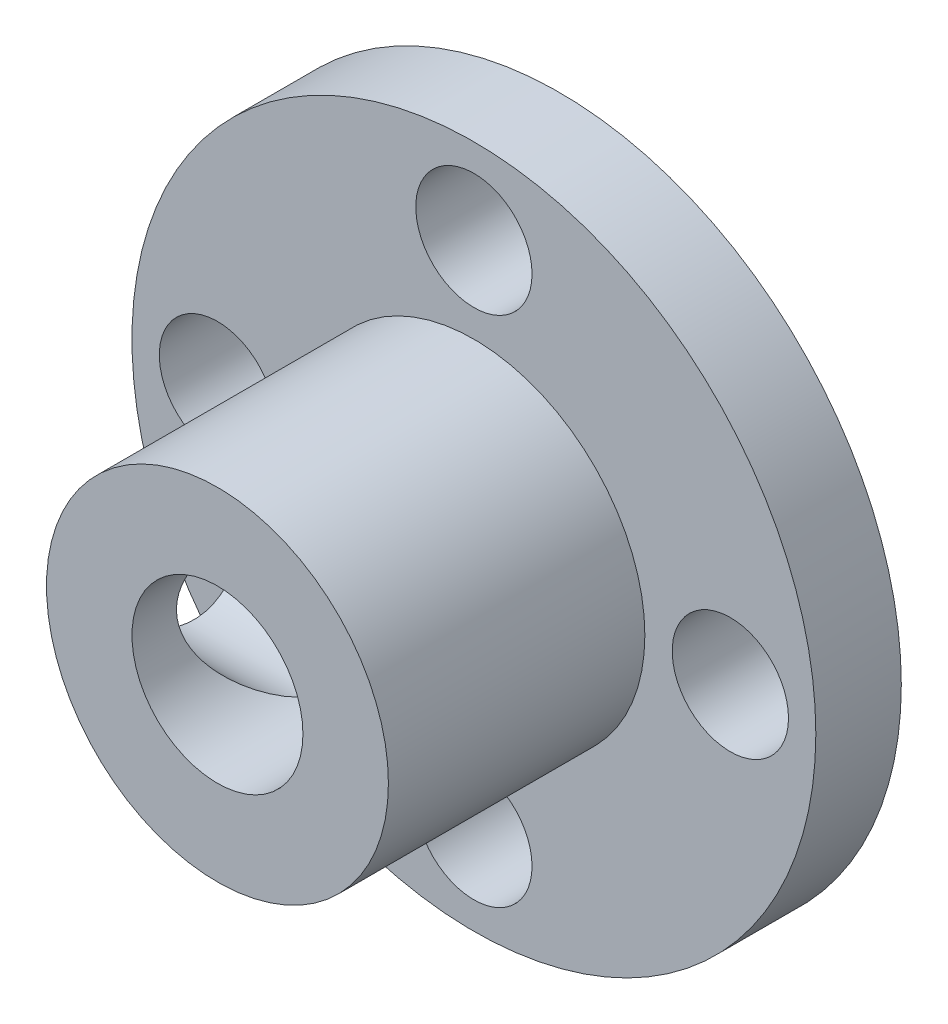
ISO-10303-21;
HEADER;
FILE_DESCRIPTION(('STEP AP214'),'2;1');
FILE_NAME('part.step','',(''),(''),'','','');
FILE_SCHEMA(('AUTOMOTIVE_DESIGN { 1 0 10303 214 1 1 1 1 }'));
ENDSEC;
DATA;
#1=APPLICATION_CONTEXT('core data for automotive mechanical design processes');
#2=APPLICATION_PROTOCOL_DEFINITION('international standard','automotive_design',2000,#1);
#3=PRODUCT_CONTEXT('',#1,'mechanical');
#4=PRODUCT('Part','Part','',(#3));
#5=PRODUCT_RELATED_PRODUCT_CATEGORY('part','',(#4));
#6=PRODUCT_DEFINITION_FORMATION('','',#4);
#7=PRODUCT_DEFINITION_CONTEXT('part definition',#1,'design');
#8=PRODUCT_DEFINITION('design','',#6,#7);
#9=PRODUCT_DEFINITION_SHAPE('','',#8);
#10=(LENGTH_UNIT() NAMED_UNIT(*) SI_UNIT(.MILLI.,.METRE.));
#11=(NAMED_UNIT(*) PLANE_ANGLE_UNIT() SI_UNIT($,.RADIAN.));
#12=(NAMED_UNIT(*) SI_UNIT($,.STERADIAN.) SOLID_ANGLE_UNIT());
#13=UNCERTAINTY_MEASURE_WITH_UNIT(LENGTH_MEASURE(1.E-05),#10,'distance_accuracy_value','');
#14=(GEOMETRIC_REPRESENTATION_CONTEXT(3) GLOBAL_UNCERTAINTY_ASSIGNED_CONTEXT((#13)) GLOBAL_UNIT_ASSIGNED_CONTEXT((#10,
#11,#12)) REPRESENTATION_CONTEXT('',''));
#15=CARTESIAN_POINT('',(0.,0.,0.));
#16=DIRECTION('',(0.,0.,1.));
#17=DIRECTION('',(1.,0.,0.));
#18=AXIS2_PLACEMENT_3D('',#15,#16,#17);
#19=CARTESIAN_POINT('',(0.,0.,3.175));
#20=DIRECTION('',(0.,0.,1.));
#21=DIRECTION('',(1.,0.,0.));
#22=AXIS2_PLACEMENT_3D('',#19,#20,#21);
#23=PLANE('',#22);
#24=CARTESIAN_POINT('',(0.,0.,3.175));
#25=DIRECTION('',(0.,0.,1.));
#26=DIRECTION('',(1.,0.,0.));
#27=AXIS2_PLACEMENT_3D('',#24,#25,#26);
#28=CIRCLE('',#27,12.7);
#29=CARTESIAN_POINT('',(12.7,0.,3.175));
#30=VERTEX_POINT('',#29);
#31=EDGE_CURVE('E11',#30,#30,#28,.T.);
#32=ORIENTED_EDGE('',*,*,#31,.T.);
#33=EDGE_LOOP('',(#32));
#34=FACE_BOUND('',#33,.T.);
#35=CARTESIAN_POINT('',(0.,9.525,3.175));
#36=DIRECTION('',(0.,0.,1.));
#37=DIRECTION('',(1.,0.,0.));
#38=AXIS2_PLACEMENT_3D('',#35,#36,#37);
#39=CIRCLE('',#38,2.159);
#40=CARTESIAN_POINT('',(2.159,9.525,3.175));
#41=VERTEX_POINT('',#40);
#42=EDGE_CURVE('E63',#41,#41,#39,.T.);
#43=ORIENTED_EDGE('',*,*,#42,.F.);
#44=EDGE_LOOP('',(#43));
#45=FACE_BOUND('',#44,.T.);
#46=CARTESIAN_POINT('',(9.52500000000027,2.68967068210316E-13,3.175));
#47=DIRECTION('',(0.,0.,1.));
#48=DIRECTION('',(1.,0.,0.));
#49=AXIS2_PLACEMENT_3D('',#46,#47,#48);
#50=CIRCLE('',#49,2.15900000000021);
#51=CARTESIAN_POINT('',(11.6840000000005,2.68967068210316E-13,3.175));
#52=VERTEX_POINT('',#51);
#53=EDGE_CURVE('E69',#52,#52,#50,.T.);
#54=ORIENTED_EDGE('',*,*,#53,.F.);
#55=EDGE_LOOP('',(#54));
#56=FACE_BOUND('',#55,.T.);
#57=CARTESIAN_POINT('',(5.37934136420633E-13,-9.525,3.175));
#58=DIRECTION('',(0.,0.,1.));
#59=DIRECTION('',(1.,0.,0.));
#60=AXIS2_PLACEMENT_3D('',#57,#58,#59);
#61=CIRCLE('',#60,2.15900000000058);
#62=CARTESIAN_POINT('',(2.15900000000112,-9.525,3.175));
#63=VERTEX_POINT('',#62);
#64=EDGE_CURVE('E97',#63,#63,#61,.T.);
#65=ORIENTED_EDGE('',*,*,#64,.F.);
#66=EDGE_LOOP('',(#65));
#67=FACE_BOUND('',#66,.T.);
#68=CARTESIAN_POINT('',(-9.52499999999973,-2.70133544286504E-13,3.175));
#69=DIRECTION('',(0.,0.,1.));
#70=DIRECTION('',(1.,0.,0.));
#71=AXIS2_PLACEMENT_3D('',#68,#69,#70);
#72=CIRCLE('',#71,2.15900000000043);
#73=CARTESIAN_POINT('',(-7.3659999999993,-2.70133544286504E-13,3.175));
#74=VERTEX_POINT('',#73);
#75=EDGE_CURVE('E92',#74,#74,#72,.T.);
#76=ORIENTED_EDGE('',*,*,#75,.F.);
#77=EDGE_LOOP('',(#76));
#78=FACE_BOUND('',#77,.T.);
#79=CARTESIAN_POINT('',(0.,0.,3.175));
#80=DIRECTION('',(0.,0.,1.));
#81=DIRECTION('',(1.,0.,0.));
#82=AXIS2_PLACEMENT_3D('',#79,#80,#81);
#83=CIRCLE('',#82,6.35);
#84=CARTESIAN_POINT('',(6.35,0.,3.175));
#85=VERTEX_POINT('',#84);
#86=EDGE_CURVE('E78',#85,#85,#83,.T.);
#87=ORIENTED_EDGE('',*,*,#86,.F.);
#88=EDGE_LOOP('',(#87));
#89=FACE_BOUND('',#88,.T.);
#90=ADVANCED_FACE('F49',(#34,#45,#56,#67,#78,#89),#23,.T.);
#91=CARTESIAN_POINT('',(0.,0.,0.));
#92=DIRECTION('',(0.,0.,1.));
#93=DIRECTION('',(1.,0.,0.));
#94=AXIS2_PLACEMENT_3D('',#91,#92,#93);
#95=PLANE('',#94);
#96=CARTESIAN_POINT('',(0.,0.,0.));
#97=DIRECTION('',(0.,0.,1.));
#98=DIRECTION('',(1.,0.,0.));
#99=AXIS2_PLACEMENT_3D('',#96,#97,#98);
#100=CIRCLE('',#99,12.7);
#101=CARTESIAN_POINT('',(12.7,0.,0.));
#102=VERTEX_POINT('',#101);
#103=EDGE_CURVE('E89',#102,#102,#100,.T.);
#104=ORIENTED_EDGE('',*,*,#103,.F.);
#105=EDGE_LOOP('',(#104));
#106=FACE_BOUND('',#105,.T.);
#107=CARTESIAN_POINT('',(0.,9.525,0.));
#108=DIRECTION('',(0.,0.,1.));
#109=DIRECTION('',(1.,0.,0.));
#110=AXIS2_PLACEMENT_3D('',#107,#108,#109);
#111=CIRCLE('',#110,2.159);
#112=CARTESIAN_POINT('',(2.159,9.525,0.));
#113=VERTEX_POINT('',#112);
#114=EDGE_CURVE('E86',#113,#113,#111,.T.);
#115=ORIENTED_EDGE('',*,*,#114,.T.);
#116=EDGE_LOOP('',(#115));
#117=FACE_BOUND('',#116,.T.);
#118=CARTESIAN_POINT('',(9.52500000000027,2.68967068210316E-13,0.));
#119=DIRECTION('',(0.,0.,1.));
#120=DIRECTION('',(1.,0.,0.));
#121=AXIS2_PLACEMENT_3D('',#118,#119,#120);
#122=CIRCLE('',#121,2.15900000000021);
#123=CARTESIAN_POINT('',(11.6840000000005,2.68967068210316E-13,0.));
#124=VERTEX_POINT('',#123);
#125=EDGE_CURVE('E82',#124,#124,#122,.T.);
#126=ORIENTED_EDGE('',*,*,#125,.T.);
#127=EDGE_LOOP('',(#126));
#128=FACE_BOUND('',#127,.T.);
#129=CARTESIAN_POINT('',(5.37934136420633E-13,-9.525,0.));
#130=DIRECTION('',(0.,0.,1.));
#131=DIRECTION('',(1.,0.,0.));
#132=AXIS2_PLACEMENT_3D('',#129,#130,#131);
#133=CIRCLE('',#132,2.15900000000058);
#134=CARTESIAN_POINT('',(2.15900000000112,-9.525,0.));
#135=VERTEX_POINT('',#134);
#136=EDGE_CURVE('E77',#135,#135,#133,.T.);
#137=ORIENTED_EDGE('',*,*,#136,.T.);
#138=EDGE_LOOP('',(#137));
#139=FACE_BOUND('',#138,.T.);
#140=CARTESIAN_POINT('',(-9.52499999999973,-2.70133544286504E-13,0.));
#141=DIRECTION('',(0.,0.,1.));
#142=DIRECTION('',(1.,0.,0.));
#143=AXIS2_PLACEMENT_3D('',#140,#141,#142);
#144=CIRCLE('',#143,2.15900000000043);
#145=CARTESIAN_POINT('',(-7.3659999999993,-2.70133544286504E-13,0.));
#146=VERTEX_POINT('',#145);
#147=EDGE_CURVE('E73',#146,#146,#144,.T.);
#148=ORIENTED_EDGE('',*,*,#147,.T.);
#149=EDGE_LOOP('',(#148));
#150=FACE_BOUND('',#149,.T.);
#151=CARTESIAN_POINT('',(0.,0.,0.));
#152=DIRECTION('',(0.,0.,1.));
#153=DIRECTION('',(1.,0.,0.));
#154=AXIS2_PLACEMENT_3D('',#151,#152,#153);
#155=CIRCLE('',#154,3.175);
#156=CARTESIAN_POINT('',(3.175,0.,0.));
#157=VERTEX_POINT('',#156);
#158=EDGE_CURVE('E133',#157,#157,#155,.T.);
#159=ORIENTED_EDGE('',*,*,#158,.T.);
#160=EDGE_LOOP('',(#159));
#161=FACE_BOUND('',#160,.T.);
#162=ADVANCED_FACE('F115',(#106,#117,#128,#139,#150,#161),#95,.F.);
#163=CARTESIAN_POINT('',(0.,9.525,3.175));
#164=DIRECTION('',(0.,0.,-1.));
#165=DIRECTION('',(-1.,0.,0.));
#166=AXIS2_PLACEMENT_3D('',#163,#164,#165);
#167=CYLINDRICAL_SURFACE('',#166,2.159);
#168=ORIENTED_EDGE('',*,*,#42,.T.);
#169=EDGE_LOOP('',(#168));
#170=FACE_BOUND('',#169,.T.);
#171=ORIENTED_EDGE('',*,*,#114,.F.);
#172=EDGE_LOOP('',(#171));
#173=FACE_BOUND('',#172,.T.);
#174=ADVANCED_FACE('F187',(#170,#173),#167,.F.);
#175=CARTESIAN_POINT('',(9.52500000000027,2.68967068210316E-13,3.175));
#176=DIRECTION('',(0.,0.,-1.));
#177=DIRECTION('',(-1.,0.,0.));
#178=AXIS2_PLACEMENT_3D('',#175,#176,#177);
#179=CYLINDRICAL_SURFACE('',#178,2.15900000000021);
#180=ORIENTED_EDGE('',*,*,#53,.T.);
#181=EDGE_LOOP('',(#180));
#182=FACE_BOUND('',#181,.T.);
#183=ORIENTED_EDGE('',*,*,#125,.F.);
#184=EDGE_LOOP('',(#183));
#185=FACE_BOUND('',#184,.T.);
#186=ADVANCED_FACE('F110',(#182,#185),#179,.F.);
#187=CARTESIAN_POINT('',(5.37934136420633E-13,-9.525,3.175));
#188=DIRECTION('',(0.,0.,-1.));
#189=DIRECTION('',(-1.,0.,0.));
#190=AXIS2_PLACEMENT_3D('',#187,#188,#189);
#191=CYLINDRICAL_SURFACE('',#190,2.15900000000058);
#192=ORIENTED_EDGE('',*,*,#64,.T.);
#193=EDGE_LOOP('',(#192));
#194=FACE_BOUND('',#193,.T.);
#195=ORIENTED_EDGE('',*,*,#136,.F.);
#196=EDGE_LOOP('',(#195));
#197=FACE_BOUND('',#196,.T.);
#198=ADVANCED_FACE('F184',(#194,#197),#191,.F.);
#199=CARTESIAN_POINT('',(-9.52499999999973,-2.70133544286504E-13,3.175));
#200=DIRECTION('',(0.,0.,-1.));
#201=DIRECTION('',(-1.,0.,0.));
#202=AXIS2_PLACEMENT_3D('',#199,#200,#201);
#203=CYLINDRICAL_SURFACE('',#202,2.15900000000043);
#204=ORIENTED_EDGE('',*,*,#75,.T.);
#205=EDGE_LOOP('',(#204));
#206=FACE_BOUND('',#205,.T.);
#207=ORIENTED_EDGE('',*,*,#147,.F.);
#208=EDGE_LOOP('',(#207));
#209=FACE_BOUND('',#208,.T.);
#210=ADVANCED_FACE('F51',(#206,#209),#203,.F.);
#211=CARTESIAN_POINT('',(0.,0.,3.175));
#212=DIRECTION('',(0.,0.,-1.));
#213=DIRECTION('',(-1.,0.,0.));
#214=AXIS2_PLACEMENT_3D('',#211,#212,#213);
#215=CYLINDRICAL_SURFACE('',#214,12.7);
#216=ORIENTED_EDGE('',*,*,#31,.F.);
#217=EDGE_LOOP('',(#216));
#218=FACE_BOUND('',#217,.T.);
#219=ORIENTED_EDGE('',*,*,#103,.T.);
#220=EDGE_LOOP('',(#219));
#221=FACE_BOUND('',#220,.T.);
#222=ADVANCED_FACE('F168',(#218,#221),#215,.T.);
#223=CARTESIAN_POINT('',(0.,0.,12.7));
#224=DIRECTION('',(0.,0.,-1.));
#225=DIRECTION('',(-1.,0.,0.));
#226=AXIS2_PLACEMENT_3D('',#223,#224,#225);
#227=CYLINDRICAL_SURFACE('',#226,3.175);
#228=CARTESIAN_POINT('',(-3.175,0.,11.049));
#229=CARTESIAN_POINT('',(-3.17499964754198,-0.0690055763738623,11.0489996447729));
#230=CARTESIAN_POINT('',(-3.17274390748717,-0.138016804472445,11.0466501704199));
#231=CARTESIAN_POINT('',(-3.16378113682923,-0.275444651350983,11.037312147526));
#232=CARTESIAN_POINT('',(-3.15707193190461,-0.343860963135813,11.0303213329366));
#233=CARTESIAN_POINT('',(-3.13041893145382,-0.54753452201083,11.002538203792));
#234=CARTESIAN_POINT('',(-3.10395004144857,-0.681111122689802,10.9749354901516));
#235=CARTESIAN_POINT('',(-3.03598154360495,-0.938685160780056,10.9039238656338));
#236=CARTESIAN_POINT('',(-2.9945873028953,-1.06274253320526,10.8606257469711));
#237=CARTESIAN_POINT('',(-2.89940038107255,-1.3001813317638,10.7607876396279));
#238=CARTESIAN_POINT('',(-2.84560716326233,-1.41356229546311,10.7042470777386));
#239=CARTESIAN_POINT('',(-2.70420471136509,-1.6726322835104,10.5550523090532));
#240=CARTESIAN_POINT('',(-2.61175725234849,-1.8126048357332,10.4570797566662));
#241=CARTESIAN_POINT('',(-2.41347832476399,-2.06934156734714,10.2451020255029));
#242=CARTESIAN_POINT('',(-2.30760765062263,-2.18603507633407,10.1310497683555));
#243=CARTESIAN_POINT('',(-2.1244924500471,-2.36166379077212,9.93081492890434));
#244=CARTESIAN_POINT('',(-2.04945697338893,-2.4268916918094,9.84800079588816));
#245=CARTESIAN_POINT('',(-1.89714912138227,-2.5477239042411,9.67740887268321));
#246=CARTESIAN_POINT('',(-1.81987525739339,-2.60332163121617,9.58962774039783));
#247=CARTESIAN_POINT('',(-1.66489148783412,-2.70505860643667,9.40942335405048));
#248=CARTESIAN_POINT('',(-1.58718244361147,-2.7512123794527,9.31700750495538));
#249=CARTESIAN_POINT('',(-1.43344607552509,-2.83433177139599,9.12690004490604));
#250=CARTESIAN_POINT('',(-1.35741705640832,-2.87130707756862,9.02921412989342));
#251=CARTESIAN_POINT('',(-1.23480497069507,-2.9255482392964,8.85928306536321));
#252=CARTESIAN_POINT('',(-1.18663136574347,-2.94532509126068,8.78898993207368));
#253=CARTESIAN_POINT('',(-1.09561635725242,-2.98036857146998,8.64387365234404));
#254=CARTESIAN_POINT('',(-1.05277020572482,-2.99563923268415,8.56905462922553));
#255=CARTESIAN_POINT('',(-0.98921602921636,-3.0170914901271,8.43737904370633));
#256=CARTESIAN_POINT('',(-0.965757290057632,-3.02462363110795,8.38210917825269));
#257=CARTESIAN_POINT('',(-0.926863509767665,-3.03676948215375,8.26852759205698));
#258=CARTESIAN_POINT('',(-0.91140332909702,-3.04139234613823,8.2102260436205));
#259=CARTESIAN_POINT('',(-0.893334330846627,-3.04674550489487,8.10144274648082));
#260=CARTESIAN_POINT('',(-0.889007694163388,-3.04799779025883,8.05128533410527));
#261=CARTESIAN_POINT('',(-0.888992328996543,-3.04800220300784,7.95100149268439));
#262=CARTESIAN_POINT('',(-0.893298164945732,-3.04675590366461,7.9008750640099));
#263=CARTESIAN_POINT('',(-0.91197467873238,-3.0412234641817,7.78820624739498));
#264=CARTESIAN_POINT('',(-0.928832658467046,-3.0361818210488,7.72613110126085));
#265=CARTESIAN_POINT('',(-0.971401353137971,-3.02282887450519,7.60534243368214));
#266=CARTESIAN_POINT('',(-0.997157760466625,-3.01450066291697,7.54664812385906));
#267=CARTESIAN_POINT('',(-1.06407366177978,-2.99165706204786,7.41242120495534));
#268=CARTESIAN_POINT('',(-1.10746403965703,-2.97599572301857,7.33823110801504));
#269=CARTESIAN_POINT('',(-1.19930069312917,-2.94019701997637,7.19411607003276));
#270=CARTESIAN_POINT('',(-1.24775774463055,-2.92005000865044,7.12420074214812));
#271=CARTESIAN_POINT('',(-1.34747584852343,-2.87540188919002,6.98730901599647));
#272=CARTESIAN_POINT('',(-1.39874940556287,-2.85088005725531,6.92034858603071));
#273=CARTESIAN_POINT('',(-1.50242851596492,-2.797630070201,6.78915291816306));
#274=CARTESIAN_POINT('',(-1.55483306783291,-2.76890551602154,6.7249154074025));
#275=CARTESIAN_POINT('',(-1.6835780701764,-2.69332299016728,6.57037467416341));
#276=CARTESIAN_POINT('',(-1.76008310323781,-2.64411992565917,6.48134266467352));
#277=CARTESIAN_POINT('',(-1.91190977900846,-2.53651404077148,6.3078318346703));
#278=CARTESIAN_POINT('',(-1.98723065516254,-2.4781055108345,6.22335588392392));
#279=CARTESIAN_POINT('',(-2.13493911616152,-2.35203077512426,6.05963891784691));
#280=CARTESIAN_POINT('',(-2.20733737548104,-2.28440314710299,5.98037802768286));
#281=CARTESIAN_POINT('',(-2.34814882323743,-2.13940126694524,5.82743903546013));
#282=CARTESIAN_POINT('',(-2.41656269197605,-2.06202868585592,5.75375997969931));
#283=CARTESIAN_POINT('',(-2.5676291308499,-1.87260234348689,5.59196016865934));
#284=CARTESIAN_POINT('',(-2.64843758465592,-1.75708968905958,5.50609191331027));
#285=CARTESIAN_POINT('',(-2.79714413144757,-1.50912216596463,5.34876555316307));
#286=CARTESIAN_POINT('',(-2.86505606349834,-1.37668571629983,5.27729199658243));
#287=CARTESIAN_POINT('',(-2.97358025011812,-1.12001101561739,5.16337713538723));
#288=CARTESIAN_POINT('',(-3.01686935306912,-0.99819395282019,5.11806755378925));
#289=CARTESIAN_POINT('',(-3.08894437428958,-0.745806843721085,5.04272732472521));
#290=CARTESIAN_POINT('',(-3.11773995779763,-0.615242696565128,5.01268649491269));
#291=CARTESIAN_POINT('',(-3.15878704787612,-0.347933877264838,4.96988601914967));
#292=CARTESIAN_POINT('',(-3.17094487952398,-0.211158653695328,4.95722422054036));
#293=CARTESIAN_POINT('',(-3.17733251494391,0.0632595993499849,4.95057018094409));
#294=CARTESIAN_POINT('',(-3.17156636186954,0.200902426128563,4.95657372957283));
#295=CARTESIAN_POINT('',(-3.1439905266141,0.459697294054803,4.98531280836605));
#296=CARTESIAN_POINT('',(-3.12370893394056,0.581199779270597,5.00645476168358));
#297=CARTESIAN_POINT('',(-3.07021143786151,0.818032307361692,5.06230282192683));
#298=CARTESIAN_POINT('',(-3.03699322258559,0.933361242785312,5.09701135330474));
#299=CARTESIAN_POINT('',(-2.95692430730525,1.16318699419833,5.18084991771867));
#300=CARTESIAN_POINT('',(-2.90931605529698,1.27712215291945,5.23078324664581));
#301=CARTESIAN_POINT('',(-2.80394786637774,1.4943603744654,5.3416587015371));
#302=CARTESIAN_POINT('',(-2.74618222288619,1.59765740862255,5.40260701642975));
#303=CARTESIAN_POINT('',(-2.587772231605,1.84845183747366,5.57048083016535));
#304=CARTESIAN_POINT('',(-2.48132959520055,1.98798651200487,5.68393953788643));
#305=CARTESIAN_POINT('',(-2.31249853167448,2.177195295772,5.86609018382358));
#306=CARTESIAN_POINT('',(-2.25458133291395,2.23700527517538,5.92892451719501));
#307=CARTESIAN_POINT('',(-2.13640433894221,2.35012289345674,6.05816936082573));
#308=CARTESIAN_POINT('',(-2.0761449661134,2.40343169763323,6.12457922710593));
#309=CARTESIAN_POINT('',(-1.95238962049547,2.50507254595819,6.26247848836939));
#310=CARTESIAN_POINT('',(-1.88885019545703,2.55322960308198,6.33405694718327));
#311=CARTESIAN_POINT('',(-1.76094395703506,2.64306740942521,6.48051252640628));
#312=CARTESIAN_POINT('',(-1.69657688074199,2.68474604279973,6.55539071429747));
#313=CARTESIAN_POINT('',(-1.5682364934062,2.76167421806575,6.70841236918113));
#314=CARTESIAN_POINT('',(-1.50426265969775,2.7969361197564,6.78654919462548));
#315=CARTESIAN_POINT('',(-1.37815503716016,2.86117029987586,6.94674021836305));
#316=CARTESIAN_POINT('',(-1.3160199208624,2.8901472164166,7.02879147300812));
#317=CARTESIAN_POINT('',(-1.20869704616471,2.9363852599177,7.18070512976252));
#318=CARTESIAN_POINT('',(-1.16265422970572,2.95483019213466,7.24959817808675));
#319=CARTESIAN_POINT('',(-1.0761454987775,2.98741482121436,7.391909192691));
#320=CARTESIAN_POINT('',(-1.03567697866368,3.00155653333429,7.46532502146055));
#321=CARTESIAN_POINT('',(-0.976466291789694,3.02122507713167,7.59438942649101));
#322=CARTESIAN_POINT('',(-0.954878021118144,3.02806350135234,7.64849025299197));
#323=CARTESIAN_POINT('',(-0.919741681589087,3.03892100062699,7.75944311616608));
#324=CARTESIAN_POINT('',(-0.90616440647885,3.0429503268911,7.81628433142037));
#325=CARTESIAN_POINT('',(-0.88975862346388,3.04779355008012,7.93262460369619));
#326=CARTESIAN_POINT('',(-0.887092650224665,3.04855883283484,7.99215058806206));
#327=CARTESIAN_POINT('',(-0.893752582829481,3.04661058552009,8.11047641954668));
#328=CARTESIAN_POINT('',(-0.903092839692187,3.04389289226916,8.16927531270237));
#329=CARTESIAN_POINT('',(-0.934633489696403,3.03436881129615,8.2976368096187));
#330=CARTESIAN_POINT('',(-0.959339966396629,3.02675174224616,8.36648218011465));
#331=CARTESIAN_POINT('',(-1.01762809872675,3.0076576993993,8.49987827344802));
#332=CARTESIAN_POINT('',(-1.0512565209004,2.99616029686241,8.56440405436172));
#333=CARTESIAN_POINT('',(-1.13944888446737,2.96400630943051,8.71761326629679));
#334=CARTESIAN_POINT('',(-1.19668847625288,2.94154847245704,8.80433824727896));
#335=CARTESIAN_POINT('',(-1.31571123153039,2.89029067987452,8.97273021132025));
#336=CARTESIAN_POINT('',(-1.37750307032612,2.86147839476351,9.05438696029393));
#337=CARTESIAN_POINT('',(-1.50306747553658,2.79756864262764,9.21397634473339));
#338=CARTESIAN_POINT('',(-1.56684462475609,2.76245557957698,9.29189911705751));
#339=CARTESIAN_POINT('',(-1.69460900364184,2.68597724332,9.44429103622927));
#340=CARTESIAN_POINT('',(-1.75859601399346,2.64461720383334,9.51876300654293));
#341=CARTESIAN_POINT('',(-1.88939881881494,2.55294498230626,9.66860763247555));
#342=CARTESIAN_POINT('',(-1.9561696989589,2.50225857231172,9.74379262787427));
#343=CARTESIAN_POINT('',(-2.08783106326889,2.39351081065975,9.89037726857305));
#344=CARTESIAN_POINT('',(-2.15272089072351,2.33544692057605,9.96177559892388));
#345=CARTESIAN_POINT('',(-2.34280512895578,2.15013533797732,10.1693008159076));
#346=CARTESIAN_POINT('',(-2.46396988859578,2.01139324467647,10.2993823385726));
#347=CARTESIAN_POINT('',(-2.65394583773868,1.74793620422452,10.5017798338184));
#348=CARTESIAN_POINT('',(-2.7276655306796,1.63112686272808,10.5798247930085));
#349=CARTESIAN_POINT('',(-2.86193964813199,1.38198017984255,10.7214583701154));
#350=CARTESIAN_POINT('',(-2.92250309569152,1.2496535772944,10.7850568973143));
#351=CARTESIAN_POINT('',(-3.01826499290941,0.993181320621948,10.8854040481998));
#352=CARTESIAN_POINT('',(-3.05595158408782,0.871005979650531,10.9247990201651));
#353=CARTESIAN_POINT('',(-3.11667460861295,0.619358523686289,10.9882102080382));
#354=CARTESIAN_POINT('',(-3.1397456536808,0.489904444101362,11.0122627579539));
#355=CARTESIAN_POINT('',(-3.16141890749836,0.299401659784497,11.0348509093149));
#356=CARTESIAN_POINT('',(-3.16650130663425,0.239778326857092,11.0401463030428));
#357=CARTESIAN_POINT('',(-3.17329239017383,0.120104818837333,11.0472214030352));
#358=CARTESIAN_POINT('',(-3.17500030673909,0.0600545497177201,11.049000309149));
#359=CARTESIAN_POINT('',(-3.175,0.,11.049));
#360=B_SPLINE_CURVE_WITH_KNOTS('',3,(#228,#229,#230,#231,#232,#233,#234,#235,#236,#237,#238,
#239,#240,#241,#242,#243,#244,#245,#246,#247,#248,#249,#250,#251,#252,#253,#254,#255,#256,#257,
#258,#259,#260,#261,#262,#263,#264,#265,#266,#267,#268,#269,#270,#271,#272,#273,#274,#275,#276,
#277,#278,#279,#280,#281,#282,#283,#284,#285,#286,#287,#288,#289,#290,#291,#292,#293,#294,#295,
#296,#297,#298,#299,#300,#301,#302,#303,#304,#305,#306,#307,#308,#309,#310,#311,#312,#313,#314,
#315,#316,#317,#318,#319,#320,#321,#322,#323,#324,#325,#326,#327,#328,#329,#330,#331,#332,#333,
#334,#335,#336,#337,#338,#339,#340,#341,#342,#343,#344,#345,#346,#347,#348,#349,#350,#351,#352,
#353,#354,#355,#356,#357,#358,#359),.UNSPECIFIED.,.T.,.F.,(4,2,2,2,2,2,2,2,2,2,2,2,2,2,2,2,2,2,
2,2,2,2,2,2,2,2,2,2,2,2,2,2,2,2,2,2,2,2,2,2,2,2,2,2,2,2,2,2,2,2,2,2,2,2,2,2,2,2,2,2,2,2,2,2,2,
4),(0.,0.206942702826027,0.413986515970082,0.828385086874044,1.23991367650403,1.65146008274064,
2.23108347220135,2.81244056235208,3.20018265012905,3.58818881041468,3.97559365716535,
4.36258786924988,4.62481027142811,4.88679727193852,5.06789238670601,5.24841480622953,
5.39872393794396,5.54893845496133,5.74134506631478,5.93475472006687,6.19622192216747,
6.45825698775476,6.72156798597648,6.9846546833744,7.36606976841936,7.74772235847465,
8.12782430939492,8.50786116962661,9.00131816053246,9.4942426002885,9.90353780760954,
10.3125597069453,10.723875161691,11.1350978418176,11.5084091807806,11.8817872638847,
12.2799096022696,12.6782563308215,13.3014541930247,13.6141786172176,13.9268469046998,
14.2480268805182,14.5693115338933,14.8899706279108,15.2103922748242,15.4648318190187,
15.7191520216334,15.8946298740796,16.0694639569701,16.2468930933937,16.424534507789,
16.6439167727089,16.8644725161268,17.182715537076,17.5015815624386,17.8212480318519,
18.1406481550665,18.4781290222075,18.8157263250452,19.488200688815,19.9625969459334,
20.4366668097782,20.8364071826758,21.2351973387283,21.4152555976701,21.5953548228146),.UNSPECIFIED.);
#361=CARTESIAN_POINT('',(-3.175,0.,11.049));
#362=VERTEX_POINT('',#361);
#363=EDGE_CURVE('E138',#362,#362,#360,.T.);
#364=ORIENTED_EDGE('',*,*,#363,.F.);
#365=EDGE_LOOP('',(#364));
#366=FACE_BOUND('',#365,.T.);
#367=CARTESIAN_POINT('',(0.,0.,12.7));
#368=DIRECTION('',(0.,0.,1.));
#369=DIRECTION('',(1.,0.,0.));
#370=AXIS2_PLACEMENT_3D('',#367,#368,#369);
#371=CIRCLE('',#370,3.175);
#372=CARTESIAN_POINT('',(3.175,0.,12.7));
#373=VERTEX_POINT('',#372);
#374=EDGE_CURVE('E127',#373,#373,#371,.T.);
#375=ORIENTED_EDGE('',*,*,#374,.T.);
#376=EDGE_LOOP('',(#375));
#377=FACE_BOUND('',#376,.T.);
#378=ORIENTED_EDGE('',*,*,#158,.F.);
#379=EDGE_LOOP('',(#378));
#380=FACE_BOUND('',#379,.T.);
#381=ADVANCED_FACE('F151',(#366,#377,#380),#227,.F.);
#382=CARTESIAN_POINT('',(0.,0.,12.7));
#383=DIRECTION('',(0.,0.,-1.));
#384=DIRECTION('',(-1.,0.,0.));
#385=AXIS2_PLACEMENT_3D('',#382,#383,#384);
#386=CYLINDRICAL_SURFACE('',#385,6.35);
#387=CARTESIAN_POINT('',(-6.35,0.,11.049));
#388=CARTESIAN_POINT('',(-6.34999921530686,-0.0805369402941506,11.0489989930001));
#389=CARTESIAN_POINT('',(-6.34846247665488,-0.161088206071377,11.0458018324806));
#390=CARTESIAN_POINT('',(-6.34236208932879,-0.321583377469843,11.0330595414089));
#391=CARTESIAN_POINT('',(-6.33779692880857,-0.401526959551653,11.0235112402395));
#392=CARTESIAN_POINT('',(-6.3196879730696,-0.639779377958257,10.9854275540061));
#393=CARTESIAN_POINT('',(-6.30173098637776,-0.796365382071113,10.9474536099087));
#394=CARTESIAN_POINT('',(-6.25594815139778,-1.09960253252616,10.848208578065));
#395=CARTESIAN_POINT('',(-6.22815962041847,-1.24628878211845,10.7870255219427));
#396=CARTESIAN_POINT('',(-6.16530720887186,-1.52715311432226,10.6435319334903));
#397=CARTESIAN_POINT('',(-6.1302442869498,-1.66133284171462,10.5612241847092));
#398=CARTESIAN_POINT('',(-6.0537672899765,-1.9219505689037,10.3724465237636));
#399=CARTESIAN_POINT('',(-6.0121050168146,-2.04751034293755,10.2648661466712));
#400=CARTESIAN_POINT('',(-5.92800198424897,-2.27959548441369,10.0310098670554));
#401=CARTESIAN_POINT('',(-5.88556070374585,-2.38610755761988,9.90472101859217));
#402=CARTESIAN_POINT('',(-5.80128655588916,-2.58457212383389,9.62625665503458));
#403=CARTESIAN_POINT('',(-5.7597041827383,-2.67498379350049,9.47288796004819));
#404=CARTESIAN_POINT('',(-5.70442066795079,-2.78996327518006,9.23160066289248));
#405=CARTESIAN_POINT('',(-5.68716973743496,-2.82485864343299,9.14926858881401));
#406=CARTESIAN_POINT('',(-5.65566355250919,-2.88742049524758,8.98136549396717));
#407=CARTESIAN_POINT('',(-5.6414065907048,-2.91509110113512,8.89579635226743));
#408=CARTESIAN_POINT('',(-5.6171817726263,-2.96148871059406,8.72702188897863));
#409=CARTESIAN_POINT('',(-5.6070155861946,-2.98063597153779,8.6439603215724));
#410=CARTESIAN_POINT('',(-5.59026494534753,-3.01193515462077,8.47621108795301));
#411=CARTESIAN_POINT('',(-5.58367865988766,-3.02409065308597,8.39152427601076));
#412=CARTESIAN_POINT('',(-5.57436024618152,-3.04123438083475,8.22125247447868));
#413=CARTESIAN_POINT('',(-5.57162619932898,-3.04622617802055,8.13566795340599));
#414=CARTESIAN_POINT('',(-5.57011497936207,-3.04898534520974,7.96437532824208));
#415=CARTESIAN_POINT('',(-5.57133747882068,-3.04675331302664,7.8786672349639));
#416=CARTESIAN_POINT('',(-5.58021279345492,-3.03050033341828,7.64101308243358));
#417=CARTESIAN_POINT('',(-5.5921461924057,-3.00862601141292,7.48967645747999));
#418=CARTESIAN_POINT('',(-5.62697664148808,-2.94295216677494,7.19325825831551));
#419=CARTESIAN_POINT('',(-5.64987675542623,-2.89914651696105,7.0481784444442));
#420=CARTESIAN_POINT('',(-5.70456390949865,-2.79002550494707,6.76417551333658));
#421=CARTESIAN_POINT('',(-5.73654529276496,-2.72423347008608,6.62547413070644));
#422=CARTESIAN_POINT('',(-5.80579035982266,-2.57335915988135,6.36044756235907));
#423=CARTESIAN_POINT('',(-5.84305638486011,-2.48826832455373,6.23412790427239));
#424=CARTESIAN_POINT('',(-5.9238876521698,-2.28971877537145,5.98206165259405));
#425=CARTESIAN_POINT('',(-5.96768298192904,-2.17411744915347,5.85807067993249));
#426=CARTESIAN_POINT('',(-6.05311040798337,-1.92350701944705,5.63053927242226));
#427=CARTESIAN_POINT('',(-6.094741615798,-1.78849002920553,5.52700718886304));
#428=CARTESIAN_POINT('',(-6.17317974277783,-1.49603998993903,5.33951598760286));
#429=CARTESIAN_POINT('',(-6.20972962260169,-1.33792996540616,5.25649675253759));
#430=CARTESIAN_POINT('',(-6.27176154431228,-1.00778493140737,5.11888457297965));
#431=CARTESIAN_POINT('',(-6.29725171258368,-0.835760256705534,5.06427075105335));
#432=CARTESIAN_POINT('',(-6.33261801124704,-0.497124053932692,4.98921398136967));
#433=CARTESIAN_POINT('',(-6.34356056421944,-0.331143564658518,4.96643001915556));
#434=CARTESIAN_POINT('',(-6.35218966125584,0.00262225820362423,4.94842863397206));
#435=CARTESIAN_POINT('',(-6.34988177738928,0.170406803527488,4.9531996236082));
#436=CARTESIAN_POINT('',(-6.3329131072693,0.490533223385339,4.98872557508505));
#437=CARTESIAN_POINT('',(-6.31913015009671,0.64313278351055,5.01763446009965));
#438=CARTESIAN_POINT('',(-6.28167878946456,0.941043366163657,5.09780441059308));
#439=CARTESIAN_POINT('',(-6.25800925612795,1.08635355350646,5.14906803088899));
#440=CARTESIAN_POINT('',(-6.20206917861311,1.37056825558158,5.27397391303496));
#441=CARTESIAN_POINT('',(-6.16956185473256,1.50914971152474,5.34824153653991));
#442=CARTESIAN_POINT('',(-6.09916531302962,1.77236422405098,5.51635811772146));
#443=CARTESIAN_POINT('',(-6.06127374636,1.89699115039423,5.6102156298055));
#444=CARTESIAN_POINT('',(-5.97972152477157,2.1408994472819,5.8248532956008));
#445=CARTESIAN_POINT('',(-5.93585088865125,2.25863275957945,5.94731640839881));
#446=CARTESIAN_POINT('',(-5.84999932653996,2.47251242267455,6.21053462453741));
#447=CARTESIAN_POINT('',(-5.80801946809154,2.56864669773622,6.35129989128915));
#448=CARTESIAN_POINT('',(-5.72924167481115,2.73998963661441,6.65409575899555));
#449=CARTESIAN_POINT('',(-5.69270513040035,2.81425130831122,6.81673600651547));
#450=CARTESIAN_POINT('',(-5.63216233305975,2.93356364656257,7.15454012289727));
#451=CARTESIAN_POINT('',(-5.60814127627147,2.97864883967136,7.32968891586256));
#452=CARTESIAN_POINT('',(-5.57814384892379,3.03442305772877,7.67008211336198));
#453=CARTESIAN_POINT('',(-5.57069899611867,3.04791731488154,7.83473595864599));
#454=CARTESIAN_POINT('',(-5.57061126777092,3.04808183171078,8.16403576148201));
#455=CARTESIAN_POINT('',(-5.5779634605461,3.03476102853287,8.32868170337861));
#456=CARTESIAN_POINT('',(-5.60513222236739,2.98424106013504,8.63923766230411));
#457=CARTESIAN_POINT('',(-5.62388586215643,2.94907312015228,8.78558207421837));
#458=CARTESIAN_POINT('',(-5.67059310725175,2.85822787106959,9.07019008152233));
#459=CARTESIAN_POINT('',(-5.69854952148696,2.80254429943948,9.20845119448441));
#460=CARTESIAN_POINT('',(-5.76281107325881,2.6680346458306,9.48317363476796));
#461=CARTESIAN_POINT('',(-5.79955003072452,2.58790814338559,9.61889393510713));
#462=CARTESIAN_POINT('',(-5.87640203367528,2.40830476034992,9.87582314999819));
#463=CARTESIAN_POINT('',(-5.91651673262632,2.30881836544449,9.99702488196959));
#464=CARTESIAN_POINT('',(-6.00081295531003,2.08064731743916,10.2351165667969));
#465=CARTESIAN_POINT('',(-6.04496322012503,1.94996539101062,10.3501100985999));
#466=CARTESIAN_POINT('',(-6.12828854526543,1.66969501028308,10.5569153369277));
#467=CARTESIAN_POINT('',(-6.16746113428591,1.52009723765075,10.6487155506662));
#468=CARTESIAN_POINT('',(-6.21925696288547,1.28446796034744,10.7665353303023));
#469=CARTESIAN_POINT('',(-6.23536412300375,1.20403645105139,10.8025000989945));
#470=CARTESIAN_POINT('',(-6.26481958019357,1.03993489563135,10.8674632573004));
#471=CARTESIAN_POINT('',(-6.27816922258008,0.95626645248451,10.896465045082));
#472=CARTESIAN_POINT('',(-6.30168489762408,0.786510162511663,10.9471054366402));
#473=CARTESIAN_POINT('',(-6.31185813805812,0.700428283503697,10.9687607206517));
#474=CARTESIAN_POINT('',(-6.32874515218512,0.526416641747133,11.004509457373));
#475=CARTESIAN_POINT('',(-6.33546114724379,0.438488103423106,11.0186077658675));
#476=CARTESIAN_POINT('',(-6.34354930547048,0.292002586699432,11.03554344913));
#477=CARTESIAN_POINT('',(-6.34596501749414,0.233747534939407,11.0405862793496));
#478=CARTESIAN_POINT('',(-6.3491906692987,0.116997512345337,11.0473149613732));
#479=CARTESIAN_POINT('',(-6.35000057000599,0.0585025357079926,11.049000731491));
#480=CARTESIAN_POINT('',(-6.35,0.,11.049));
#481=B_SPLINE_CURVE_WITH_KNOTS('',3,(#387,#388,#389,#390,#391,#392,#393,#394,#395,#396,#397,
#398,#399,#400,#401,#402,#403,#404,#405,#406,#407,#408,#409,#410,#411,#412,#413,#414,#415,#416,
#417,#418,#419,#420,#421,#422,#423,#424,#425,#426,#427,#428,#429,#430,#431,#432,#433,#434,#435,
#436,#437,#438,#439,#440,#441,#442,#443,#444,#445,#446,#447,#448,#449,#450,#451,#452,#453,#454,
#455,#456,#457,#458,#459,#460,#461,#462,#463,#464,#465,#466,#467,#468,#469,#470,#471,#472,#473,
#474,#475,#476,#477,#478,#479,#480),.UNSPECIFIED.,.T.,.F.,(4,2,2,2,2,2,2,2,2,2,2,2,2,2,2,2,2,2,
2,2,2,2,2,2,2,2,2,2,2,2,2,2,2,2,2,2,2,2,2,2,2,2,2,2,2,2,4),(0.,0.241548904369667,
0.483218485407945,0.966985284879767,1.44893522377466,1.93082168988158,2.44019654081723,
2.94992553124394,3.49533111567705,3.76822384659499,4.04096052762413,4.29813360022246,
4.55517501009424,4.81208835526319,5.06898043991647,5.52674306825589,5.98463365788915,
6.4531761187109,6.9219268094103,7.44488584856189,7.96805791987611,8.51199352228557,
9.05552877550502,9.55649956734754,10.0572597065481,10.5228948469071,10.9885832164588,
11.468245606673,11.9481178931527,12.4721626042879,12.9964995768224,13.5410024386361,
14.0848597683822,14.5782150764229,15.0714059821404,15.5244650945088,15.9776626208619,
16.4612196368253,16.945014897176,17.4813300033002,18.0179103461196,18.2863023006385,
18.5545630034192,18.8222104787957,19.0896857687246,19.2651441299964,19.4406067605793),.UNSPECIFIED.);
#482=CARTESIAN_POINT('',(-6.35,0.,11.049));
#483=VERTEX_POINT('',#482);
#484=EDGE_CURVE('E53',#483,#483,#481,.T.);
#485=ORIENTED_EDGE('',*,*,#484,.T.);
#486=EDGE_LOOP('',(#485));
#487=FACE_BOUND('',#486,.T.);
#488=ORIENTED_EDGE('',*,*,#86,.T.);
#489=EDGE_LOOP('',(#488));
#490=FACE_BOUND('',#489,.T.);
#491=CARTESIAN_POINT('',(0.,0.,12.7));
#492=DIRECTION('',(0.,0.,1.));
#493=DIRECTION('',(1.,0.,0.));
#494=AXIS2_PLACEMENT_3D('',#491,#492,#493);
#495=CIRCLE('',#494,6.35);
#496=CARTESIAN_POINT('',(6.35,0.,12.7));
#497=VERTEX_POINT('',#496);
#498=EDGE_CURVE('E124',#497,#497,#495,.T.);
#499=ORIENTED_EDGE('',*,*,#498,.F.);
#500=EDGE_LOOP('',(#499));
#501=FACE_BOUND('',#500,.T.);
#502=ADVANCED_FACE('F160',(#487,#490,#501),#386,.T.);
#503=CARTESIAN_POINT('',(0.,0.,12.7));
#504=DIRECTION('',(0.,0.,1.));
#505=DIRECTION('',(1.,0.,0.));
#506=AXIS2_PLACEMENT_3D('',#503,#504,#505);
#507=PLANE('',#506);
#508=ORIENTED_EDGE('',*,*,#374,.F.);
#509=EDGE_LOOP('',(#508));
#510=FACE_BOUND('',#509,.T.);
#511=ORIENTED_EDGE('',*,*,#498,.T.);
#512=EDGE_LOOP('',(#511));
#513=FACE_BOUND('',#512,.T.);
#514=ADVANCED_FACE('F157',(#510,#513),#507,.T.);
#515=CARTESIAN_POINT('',(-12.7,0.,8.001));
#516=DIRECTION('',(1.,0.,0.));
#517=DIRECTION('',(0.,0.,-1.));
#518=AXIS2_PLACEMENT_3D('',#515,#516,#517);
#519=CYLINDRICAL_SURFACE('',#518,3.048);
#520=ORIENTED_EDGE('',*,*,#363,.T.);
#521=EDGE_LOOP('',(#520));
#522=FACE_BOUND('',#521,.T.);
#523=ORIENTED_EDGE('',*,*,#484,.F.);
#524=EDGE_LOOP('',(#523));
#525=FACE_BOUND('',#524,.T.);
#526=ADVANCED_FACE('F153',(#522,#525),#519,.F.);
#527=CLOSED_SHELL('',(#90,#162,#174,#186,#198,#210,#222,#381,#502,#514,#526));
#528=MANIFOLD_SOLID_BREP('B2',#527);
#529=ADVANCED_BREP_SHAPE_REPRESENTATION('',(#18,#528),#14);
#530=SHAPE_DEFINITION_REPRESENTATION(#9,#529);
ENDSEC;
END-ISO-10303-21;
